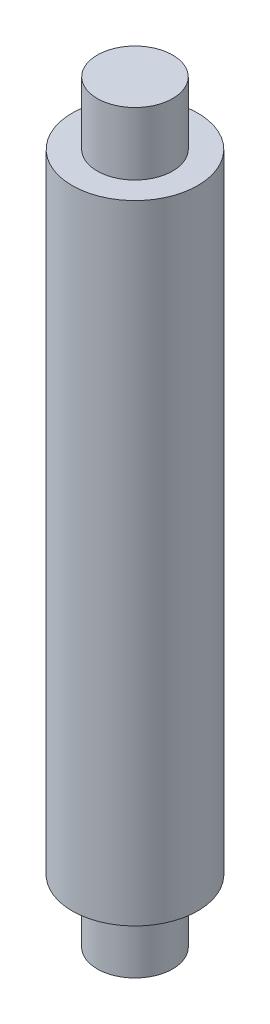
ISO-10303-21;
HEADER;
FILE_DESCRIPTION(('STEP AP214'),'2;1');
FILE_NAME('part.step','',(''),(''),'','','');
FILE_SCHEMA(('AUTOMOTIVE_DESIGN { 1 0 10303 214 1 1 1 1 }'));
ENDSEC;
DATA;
#1=APPLICATION_CONTEXT('core data for automotive mechanical design processes');
#2=APPLICATION_PROTOCOL_DEFINITION('international standard','automotive_design',2000,#1);
#3=PRODUCT_CONTEXT('',#1,'mechanical');
#4=PRODUCT('Part','Part','',(#3));
#5=PRODUCT_RELATED_PRODUCT_CATEGORY('part','',(#4));
#6=PRODUCT_DEFINITION_FORMATION('','',#4);
#7=PRODUCT_DEFINITION_CONTEXT('part definition',#1,'design');
#8=PRODUCT_DEFINITION('design','',#6,#7);
#9=PRODUCT_DEFINITION_SHAPE('','',#8);
#10=(LENGTH_UNIT() NAMED_UNIT(*) SI_UNIT(.MILLI.,.METRE.));
#11=(NAMED_UNIT(*) PLANE_ANGLE_UNIT() SI_UNIT($,.RADIAN.));
#12=(NAMED_UNIT(*) SI_UNIT($,.STERADIAN.) SOLID_ANGLE_UNIT());
#13=UNCERTAINTY_MEASURE_WITH_UNIT(LENGTH_MEASURE(1.E-05),#10,'distance_accuracy_value','');
#14=(GEOMETRIC_REPRESENTATION_CONTEXT(3) GLOBAL_UNCERTAINTY_ASSIGNED_CONTEXT((#13)) GLOBAL_UNIT_ASSIGNED_CONTEXT((#10,
#11,#12)) REPRESENTATION_CONTEXT('',''));
#15=CARTESIAN_POINT('',(0.,0.,0.));
#16=DIRECTION('',(0.,0.,1.));
#17=DIRECTION('',(1.,0.,0.));
#18=AXIS2_PLACEMENT_3D('',#15,#16,#17);
#19=CARTESIAN_POINT('',(0.,60.,0.));
#20=DIRECTION('',(0.,1.,0.));
#21=DIRECTION('',(0.,0.,1.));
#22=AXIS2_PLACEMENT_3D('',#19,#20,#21);
#23=CYLINDRICAL_SURFACE('',#22,5.99999999999998);
#24=CARTESIAN_POINT('',(0.,-60.,0.));
#25=DIRECTION('',(0.,1.,0.));
#26=DIRECTION('',(0.,0.,1.));
#27=AXIS2_PLACEMENT_3D('',#24,#25,#26);
#28=CIRCLE('',#27,5.99999999999998);
#29=CARTESIAN_POINT('',(0.,-60.,5.99999999999998));
#30=VERTEX_POINT('',#29);
#31=EDGE_CURVE('E10',#30,#30,#28,.T.);
#32=ORIENTED_EDGE('',*,*,#31,.T.);
#33=EDGE_LOOP('',(#32));
#34=FACE_BOUND('',#33,.T.);
#35=CARTESIAN_POINT('',(0.,-50.,0.));
#36=DIRECTION('',(0.,1.,0.));
#37=DIRECTION('',(0.,0.,1.));
#38=AXIS2_PLACEMENT_3D('',#35,#36,#37);
#39=CIRCLE('',#38,5.99999999999999);
#40=CARTESIAN_POINT('',(0.,-50.,5.99999999999999));
#41=VERTEX_POINT('',#40);
#42=EDGE_CURVE('E64',#41,#41,#39,.T.);
#43=ORIENTED_EDGE('',*,*,#42,.F.);
#44=EDGE_LOOP('',(#43));
#45=FACE_BOUND('',#44,.T.);
#46=ADVANCED_FACE('F37',(#34,#45),#23,.T.);
#47=CARTESIAN_POINT('',(0.,-60.,0.));
#48=DIRECTION('',(0.,-1.,0.));
#49=DIRECTION('',(0.,0.,-1.));
#50=AXIS2_PLACEMENT_3D('',#47,#48,#49);
#51=PLANE('',#50);
#52=ORIENTED_EDGE('',*,*,#31,.F.);
#53=EDGE_LOOP('',(#52));
#54=FACE_BOUND('',#53,.T.);
#55=ADVANCED_FACE('F73',(#54),#51,.T.);
#56=CARTESIAN_POINT('',(0.,60.,6.00000000000002));
#57=DIRECTION('',(0.,1.,0.));
#58=DIRECTION('',(0.,0.,1.));
#59=AXIS2_PLACEMENT_3D('',#56,#57,#58);
#60=PLANE('',#59);
#61=CARTESIAN_POINT('',(0.,60.,0.));
#62=DIRECTION('',(0.,1.,0.));
#63=DIRECTION('',(0.,0.,1.));
#64=AXIS2_PLACEMENT_3D('',#61,#62,#63);
#65=CIRCLE('',#64,6.00000000000002);
#66=CARTESIAN_POINT('',(0.,60.,6.00000000000002));
#67=VERTEX_POINT('',#66);
#68=EDGE_CURVE('E44',#67,#67,#65,.T.);
#69=ORIENTED_EDGE('',*,*,#68,.T.);
#70=EDGE_LOOP('',(#69));
#71=FACE_BOUND('',#70,.T.);
#72=ADVANCED_FACE('F77',(#71),#60,.T.);
#73=CARTESIAN_POINT('',(0.,60.,0.));
#74=DIRECTION('',(0.,1.,0.));
#75=DIRECTION('',(0.,0.,1.));
#76=AXIS2_PLACEMENT_3D('',#73,#74,#75);
#77=CYLINDRICAL_SURFACE('',#76,6.00000000000002);
#78=CARTESIAN_POINT('',(0.,50.,0.));
#79=DIRECTION('',(0.,1.,0.));
#80=DIRECTION('',(0.,0.,1.));
#81=AXIS2_PLACEMENT_3D('',#78,#79,#80);
#82=CIRCLE('',#81,6.00000000000002);
#83=CARTESIAN_POINT('',(0.,50.,6.00000000000002));
#84=VERTEX_POINT('',#83);
#85=EDGE_CURVE('E49',#84,#84,#82,.T.);
#86=ORIENTED_EDGE('',*,*,#85,.T.);
#87=EDGE_LOOP('',(#86));
#88=FACE_BOUND('',#87,.T.);
#89=ORIENTED_EDGE('',*,*,#68,.F.);
#90=EDGE_LOOP('',(#89));
#91=FACE_BOUND('',#90,.T.);
#92=ADVANCED_FACE('F82',(#88,#91),#77,.T.);
#93=CARTESIAN_POINT('',(0.,50.,9.99999999999999));
#94=DIRECTION('',(0.,1.,0.));
#95=DIRECTION('',(0.,0.,1.));
#96=AXIS2_PLACEMENT_3D('',#93,#94,#95);
#97=PLANE('',#96);
#98=CARTESIAN_POINT('',(0.,50.,0.));
#99=DIRECTION('',(0.,1.,0.));
#100=DIRECTION('',(0.,0.,1.));
#101=AXIS2_PLACEMENT_3D('',#98,#99,#100);
#102=CIRCLE('',#101,9.99999999999999);
#103=CARTESIAN_POINT('',(0.,50.,9.99999999999999));
#104=VERTEX_POINT('',#103);
#105=EDGE_CURVE('E54',#104,#104,#102,.T.);
#106=ORIENTED_EDGE('',*,*,#105,.T.);
#107=EDGE_LOOP('',(#106));
#108=FACE_BOUND('',#107,.T.);
#109=ORIENTED_EDGE('',*,*,#85,.F.);
#110=EDGE_LOOP('',(#109));
#111=FACE_BOUND('',#110,.T.);
#112=ADVANCED_FACE('F87',(#108,#111),#97,.T.);
#113=CARTESIAN_POINT('',(0.,60.,0.));
#114=DIRECTION('',(0.,1.,0.));
#115=DIRECTION('',(0.,0.,1.));
#116=AXIS2_PLACEMENT_3D('',#113,#114,#115);
#117=CYLINDRICAL_SURFACE('',#116,9.99999999999999);
#118=CARTESIAN_POINT('',(0.,-50.,0.));
#119=DIRECTION('',(0.,1.,0.));
#120=DIRECTION('',(0.,0.,1.));
#121=AXIS2_PLACEMENT_3D('',#118,#119,#120);
#122=CIRCLE('',#121,9.99999999999999);
#123=CARTESIAN_POINT('',(0.,-50.,9.99999999999999));
#124=VERTEX_POINT('',#123);
#125=EDGE_CURVE('E60',#124,#124,#122,.T.);
#126=ORIENTED_EDGE('',*,*,#125,.T.);
#127=EDGE_LOOP('',(#126));
#128=FACE_BOUND('',#127,.T.);
#129=ORIENTED_EDGE('',*,*,#105,.F.);
#130=EDGE_LOOP('',(#129));
#131=FACE_BOUND('',#130,.T.);
#132=ADVANCED_FACE('F91',(#128,#131),#117,.T.);
#133=CARTESIAN_POINT('',(0.,-50.,5.99999999999999));
#134=DIRECTION('',(0.,-1.,0.));
#135=DIRECTION('',(0.,0.,-1.));
#136=AXIS2_PLACEMENT_3D('',#133,#134,#135);
#137=PLANE('',#136);
#138=ORIENTED_EDGE('',*,*,#42,.T.);
#139=EDGE_LOOP('',(#138));
#140=FACE_BOUND('',#139,.T.);
#141=ORIENTED_EDGE('',*,*,#125,.F.);
#142=EDGE_LOOP('',(#141));
#143=FACE_BOUND('',#142,.T.);
#144=ADVANCED_FACE('F69',(#140,#143),#137,.T.);
#145=CLOSED_SHELL('',(#46,#55,#72,#92,#112,#132,#144));
#146=MANIFOLD_SOLID_BREP('B2',#145);
#147=ADVANCED_BREP_SHAPE_REPRESENTATION('',(#18,#146),#14);
#148=SHAPE_DEFINITION_REPRESENTATION(#9,#147);
ENDSEC;
END-ISO-10303-21;
